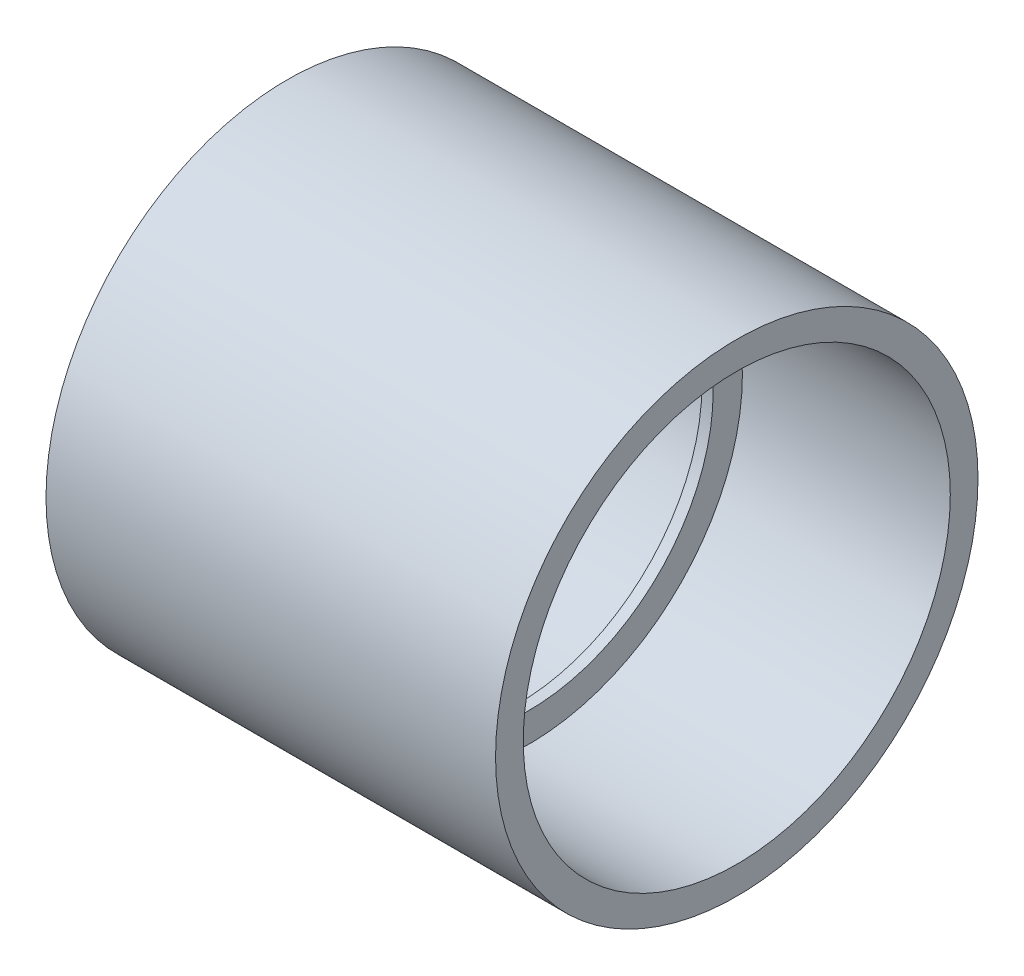
ISO-10303-21;
HEADER;
FILE_DESCRIPTION(('STEP AP214'),'2;1');
FILE_NAME('part.step','',(''),(''),'','','');
FILE_SCHEMA(('AUTOMOTIVE_DESIGN { 1 0 10303 214 1 1 1 1 }'));
ENDSEC;
DATA;
#1=APPLICATION_CONTEXT('core data for automotive mechanical design processes');
#2=APPLICATION_PROTOCOL_DEFINITION('international standard','automotive_design',2000,#1);
#3=PRODUCT_CONTEXT('',#1,'mechanical');
#4=PRODUCT('Part','Part','',(#3));
#5=PRODUCT_RELATED_PRODUCT_CATEGORY('part','',(#4));
#6=PRODUCT_DEFINITION_FORMATION('','',#4);
#7=PRODUCT_DEFINITION_CONTEXT('part definition',#1,'design');
#8=PRODUCT_DEFINITION('design','',#6,#7);
#9=PRODUCT_DEFINITION_SHAPE('','',#8);
#10=(LENGTH_UNIT() NAMED_UNIT(*) SI_UNIT(.MILLI.,.METRE.));
#11=(NAMED_UNIT(*) PLANE_ANGLE_UNIT() SI_UNIT($,.RADIAN.));
#12=(NAMED_UNIT(*) SI_UNIT($,.STERADIAN.) SOLID_ANGLE_UNIT());
#13=UNCERTAINTY_MEASURE_WITH_UNIT(LENGTH_MEASURE(1.E-05),#10,'distance_accuracy_value','');
#14=(GEOMETRIC_REPRESENTATION_CONTEXT(3) GLOBAL_UNCERTAINTY_ASSIGNED_CONTEXT((#13)) GLOBAL_UNIT_ASSIGNED_CONTEXT((#10,
#11,#12)) REPRESENTATION_CONTEXT('',''));
#15=CARTESIAN_POINT('',(0.,0.,0.));
#16=DIRECTION('',(0.,0.,1.));
#17=DIRECTION('',(1.,0.,0.));
#18=AXIS2_PLACEMENT_3D('',#15,#16,#17);
#19=CARTESIAN_POINT('',(63.5,0.,0.));
#20=DIRECTION('',(-1.,0.,0.));
#21=DIRECTION('',(0.,0.,1.));
#22=AXIS2_PLACEMENT_3D('',#19,#20,#21);
#23=CYLINDRICAL_SURFACE('',#22,30.1625);
#24=CARTESIAN_POINT('',(0.,0.,0.));
#25=DIRECTION('',(1.,0.,0.));
#26=DIRECTION('',(0.,0.,-1.));
#27=AXIS2_PLACEMENT_3D('',#24,#25,#26);
#28=CIRCLE('',#27,30.1625);
#29=CARTESIAN_POINT('',(0.,0.,-30.1625));
#30=VERTEX_POINT('',#29);
#31=EDGE_CURVE('E54',#30,#30,#28,.T.);
#32=ORIENTED_EDGE('',*,*,#31,.F.);
#33=EDGE_LOOP('',(#32));
#34=FACE_BOUND('',#33,.T.);
#35=CARTESIAN_POINT('',(32.54375,0.,0.));
#36=DIRECTION('',(1.,0.,0.));
#37=DIRECTION('',(0.,0.,-1.));
#38=AXIS2_PLACEMENT_3D('',#35,#36,#37);
#39=CIRCLE('',#38,30.1625);
#40=CARTESIAN_POINT('',(32.54375,0.,-30.1625));
#41=VERTEX_POINT('',#40);
#42=EDGE_CURVE('E57',#41,#41,#39,.T.);
#43=ORIENTED_EDGE('',*,*,#42,.T.);
#44=EDGE_LOOP('',(#43));
#45=FACE_BOUND('',#44,.T.);
#46=ADVANCED_FACE('F36',(#34,#45),#23,.F.);
#47=CARTESIAN_POINT('',(63.5,0.,0.));
#48=DIRECTION('',(1.,0.,0.));
#49=DIRECTION('',(0.,0.,-1.));
#50=AXIS2_PLACEMENT_3D('',#47,#48,#49);
#51=PLANE('',#50);
#52=CARTESIAN_POINT('',(63.5,0.,0.));
#53=DIRECTION('',(1.,0.,0.));
#54=DIRECTION('',(0.,0.,-1.));
#55=AXIS2_PLACEMENT_3D('',#52,#53,#54);
#56=CIRCLE('',#55,34.0741);
#57=CARTESIAN_POINT('',(63.5,0.,-34.0741));
#58=VERTEX_POINT('',#57);
#59=EDGE_CURVE('E43',#58,#58,#56,.T.);
#60=ORIENTED_EDGE('',*,*,#59,.T.);
#61=EDGE_LOOP('',(#60));
#62=FACE_BOUND('',#61,.T.);
#63=CARTESIAN_POINT('',(63.5,0.,0.));
#64=DIRECTION('',(1.,0.,0.));
#65=DIRECTION('',(0.,0.,-1.));
#66=AXIS2_PLACEMENT_3D('',#63,#64,#65);
#67=CIRCLE('',#66,30.1625);
#68=CARTESIAN_POINT('',(63.5,0.,-30.1625));
#69=VERTEX_POINT('',#68);
#70=EDGE_CURVE('E52',#69,#69,#67,.T.);
#71=ORIENTED_EDGE('',*,*,#70,.F.);
#72=EDGE_LOOP('',(#71));
#73=FACE_BOUND('',#72,.T.);
#74=ADVANCED_FACE('F87',(#62,#73),#51,.T.);
#75=CARTESIAN_POINT('',(0.,0.,0.));
#76=DIRECTION('',(1.,0.,0.));
#77=DIRECTION('',(0.,0.,-1.));
#78=AXIS2_PLACEMENT_3D('',#75,#76,#77);
#79=PLANE('',#78);
#80=CARTESIAN_POINT('',(0.,0.,0.));
#81=DIRECTION('',(1.,0.,0.));
#82=DIRECTION('',(0.,0.,-1.));
#83=AXIS2_PLACEMENT_3D('',#80,#81,#82);
#84=CIRCLE('',#83,34.0741);
#85=CARTESIAN_POINT('',(0.,0.,-34.0741));
#86=VERTEX_POINT('',#85);
#87=EDGE_CURVE('E47',#86,#86,#84,.T.);
#88=ORIENTED_EDGE('',*,*,#87,.F.);
#89=EDGE_LOOP('',(#88));
#90=FACE_BOUND('',#89,.T.);
#91=ORIENTED_EDGE('',*,*,#31,.T.);
#92=EDGE_LOOP('',(#91));
#93=FACE_BOUND('',#92,.T.);
#94=ADVANCED_FACE('F92',(#90,#93),#79,.F.);
#95=CARTESIAN_POINT('',(63.5,0.,0.));
#96=DIRECTION('',(-1.,0.,0.));
#97=DIRECTION('',(0.,0.,1.));
#98=AXIS2_PLACEMENT_3D('',#95,#96,#97);
#99=CYLINDRICAL_SURFACE('',#98,34.0741);
#100=ORIENTED_EDGE('',*,*,#59,.F.);
#101=EDGE_LOOP('',(#100));
#102=FACE_BOUND('',#101,.T.);
#103=ORIENTED_EDGE('',*,*,#87,.T.);
#104=EDGE_LOOP('',(#103));
#105=FACE_BOUND('',#104,.T.);
#106=ADVANCED_FACE('F38',(#102,#105),#99,.T.);
#107=CARTESIAN_POINT('',(34.13125,0.,0.));
#108=DIRECTION('',(1.,0.,0.));
#109=DIRECTION('',(0.,0.,-1.));
#110=AXIS2_PLACEMENT_3D('',#107,#108,#109);
#111=CIRCLE('',#110,30.1625);
#112=CARTESIAN_POINT('',(34.13125,0.,-30.1625));
#113=VERTEX_POINT('',#112);
#114=EDGE_CURVE('E10',#113,#113,#111,.T.);
#115=ORIENTED_EDGE('',*,*,#114,.F.);
#116=EDGE_LOOP('',(#115));
#117=FACE_BOUND('',#116,.T.);
#118=ORIENTED_EDGE('',*,*,#70,.T.);
#119=EDGE_LOOP('',(#118));
#120=FACE_BOUND('',#119,.T.);
#121=ADVANCED_FACE('F75',(#117,#120),#23,.F.);
#122=CARTESIAN_POINT('',(34.13125,0.,0.));
#123=DIRECTION('',(1.,0.,0.));
#124=DIRECTION('',(0.,0.,-1.));
#125=AXIS2_PLACEMENT_3D('',#122,#123,#124);
#126=PLANE('',#125);
#127=ORIENTED_EDGE('',*,*,#114,.T.);
#128=EDGE_LOOP('',(#127));
#129=FACE_BOUND('',#128,.T.);
#130=CARTESIAN_POINT('',(34.13125,0.,0.));
#131=DIRECTION('',(1.,0.,0.));
#132=DIRECTION('',(0.,0.,-1.));
#133=AXIS2_PLACEMENT_3D('',#130,#131,#132);
#134=CIRCLE('',#133,26.035);
#135=CARTESIAN_POINT('',(34.13125,0.,-26.035));
#136=VERTEX_POINT('',#135);
#137=EDGE_CURVE('E62',#136,#136,#134,.T.);
#138=ORIENTED_EDGE('',*,*,#137,.F.);
#139=EDGE_LOOP('',(#138));
#140=FACE_BOUND('',#139,.T.);
#141=ADVANCED_FACE('F72',(#129,#140),#126,.T.);
#142=CARTESIAN_POINT('',(32.54375,0.,0.));
#143=DIRECTION('',(1.,0.,0.));
#144=DIRECTION('',(0.,0.,-1.));
#145=AXIS2_PLACEMENT_3D('',#142,#143,#144);
#146=PLANE('',#145);
#147=ORIENTED_EDGE('',*,*,#42,.F.);
#148=EDGE_LOOP('',(#147));
#149=FACE_BOUND('',#148,.T.);
#150=CARTESIAN_POINT('',(32.54375,0.,0.));
#151=DIRECTION('',(1.,0.,0.));
#152=DIRECTION('',(0.,0.,-1.));
#153=AXIS2_PLACEMENT_3D('',#150,#151,#152);
#154=CIRCLE('',#153,26.035);
#155=CARTESIAN_POINT('',(32.54375,0.,-26.035));
#156=VERTEX_POINT('',#155);
#157=EDGE_CURVE('E63',#156,#156,#154,.T.);
#158=ORIENTED_EDGE('',*,*,#157,.T.);
#159=EDGE_LOOP('',(#158));
#160=FACE_BOUND('',#159,.T.);
#161=ADVANCED_FACE('F74',(#149,#160),#146,.F.);
#162=CARTESIAN_POINT('',(34.13125,0.,0.));
#163=DIRECTION('',(-1.,0.,0.));
#164=DIRECTION('',(0.,0.,1.));
#165=AXIS2_PLACEMENT_3D('',#162,#163,#164);
#166=CYLINDRICAL_SURFACE('',#165,26.035);
#167=ORIENTED_EDGE('',*,*,#137,.T.);
#168=EDGE_LOOP('',(#167));
#169=FACE_BOUND('',#168,.T.);
#170=ORIENTED_EDGE('',*,*,#157,.F.);
#171=EDGE_LOOP('',(#170));
#172=FACE_BOUND('',#171,.T.);
#173=ADVANCED_FACE('F69',(#169,#172),#166,.F.);
#174=CLOSED_SHELL('',(#46,#74,#94,#106,#121,#141,#161,#173));
#175=MANIFOLD_SOLID_BREP('B2',#174);
#176=ADVANCED_BREP_SHAPE_REPRESENTATION('',(#18,#175),#14);
#177=SHAPE_DEFINITION_REPRESENTATION(#9,#176);
ENDSEC;
END-ISO-10303-21;
